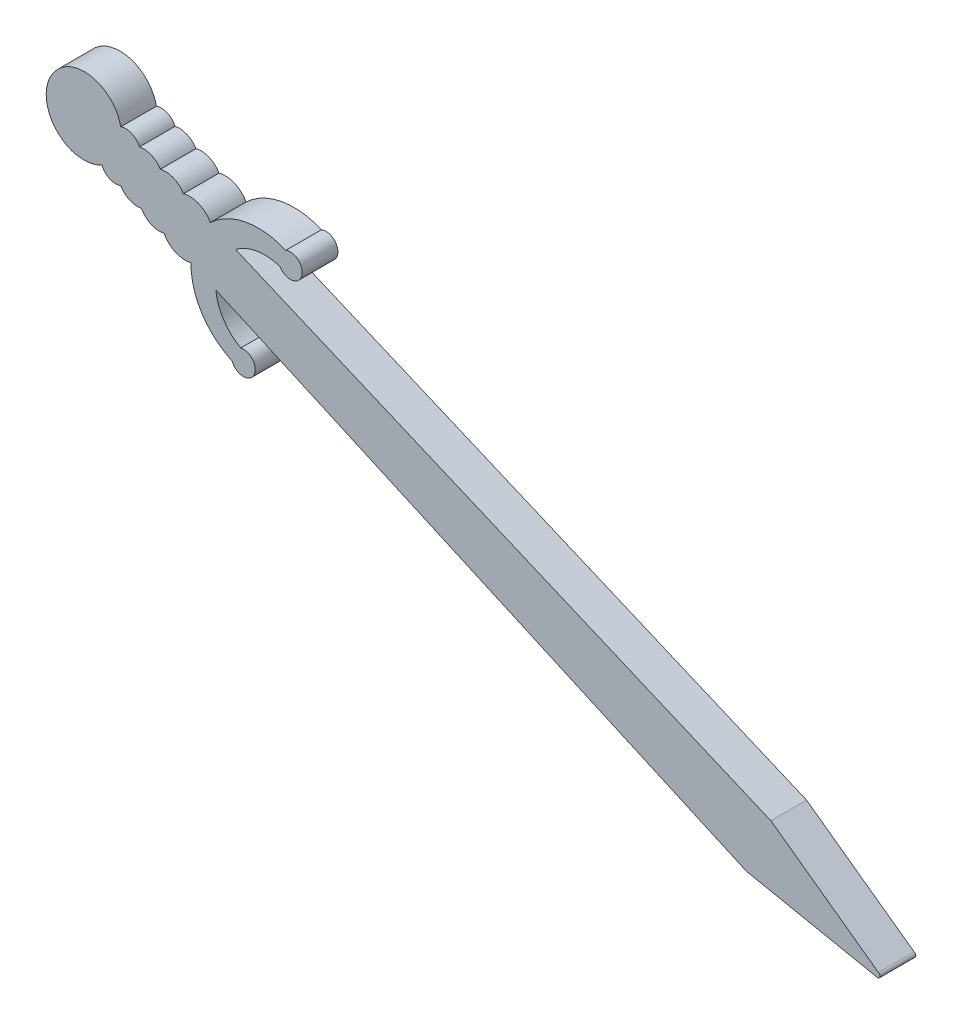
ISO-10303-21;
HEADER;
FILE_DESCRIPTION(('STEP AP214'),'2;1');
FILE_NAME('part.step','',(''),(''),'','','');
FILE_SCHEMA(('AUTOMOTIVE_DESIGN { 1 0 10303 214 1 1 1 1 }'));
ENDSEC;
DATA;
#1=APPLICATION_CONTEXT('core data for automotive mechanical design processes');
#2=APPLICATION_PROTOCOL_DEFINITION('international standard','automotive_design',2000,#1);
#3=PRODUCT_CONTEXT('',#1,'mechanical');
#4=PRODUCT('Part','Part','',(#3));
#5=PRODUCT_RELATED_PRODUCT_CATEGORY('part','',(#4));
#6=PRODUCT_DEFINITION_FORMATION('','',#4);
#7=PRODUCT_DEFINITION_CONTEXT('part definition',#1,'design');
#8=PRODUCT_DEFINITION('design','',#6,#7);
#9=PRODUCT_DEFINITION_SHAPE('','',#8);
#10=(LENGTH_UNIT() NAMED_UNIT(*) SI_UNIT(.MILLI.,.METRE.));
#11=(NAMED_UNIT(*) PLANE_ANGLE_UNIT() SI_UNIT($,.RADIAN.));
#12=(NAMED_UNIT(*) SI_UNIT($,.STERADIAN.) SOLID_ANGLE_UNIT());
#13=UNCERTAINTY_MEASURE_WITH_UNIT(LENGTH_MEASURE(1.E-05),#10,'distance_accuracy_value','');
#14=(GEOMETRIC_REPRESENTATION_CONTEXT(3) GLOBAL_UNCERTAINTY_ASSIGNED_CONTEXT((#13)) GLOBAL_UNIT_ASSIGNED_CONTEXT((#10,
#11,#12)) REPRESENTATION_CONTEXT('',''));
#15=CARTESIAN_POINT('',(0.,0.,0.));
#16=DIRECTION('',(0.,0.,1.));
#17=DIRECTION('',(1.,0.,0.));
#18=AXIS2_PLACEMENT_3D('',#15,#16,#17);
#19=CARTESIAN_POINT('',(10.7725840716379,28.2764806744875,3.));
#20=DIRECTION('',(0.,0.,-1.));
#21=DIRECTION('',(-1.,0.,0.));
#22=AXIS2_PLACEMENT_3D('',#19,#20,#21);
#23=CYLINDRICAL_SURFACE('',#22,1.98189008636702);
#24=CARTESIAN_POINT('',(10.7725840716379,28.2764806744875,0.));
#25=DIRECTION('',(0.,0.,1.));
#26=DIRECTION('',(1.,0.,0.));
#27=AXIS2_PLACEMENT_3D('',#24,#25,#26);
#28=CIRCLE('',#27,1.98189008636702);
#29=CARTESIAN_POINT('',(12.514190479064,29.2223640901642,0.));
#30=VERTEX_POINT('',#29);
#31=CARTESIAN_POINT('',(10.2421095588629,30.1860578805035,0.));
#32=VERTEX_POINT('',#31);
#33=EDGE_CURVE('E219',#30,#32,#28,.T.);
#34=ORIENTED_EDGE('',*,*,#33,.T.);
#35=DIRECTION('',(0.,0.,-1.));
#36=VECTOR('',#35,1.);
#37=CARTESIAN_POINT('',(10.2421095588629,30.1860578805035,3.));
#38=LINE('',#37,#36);
#39=CARTESIAN_POINT('',(10.2421095588629,30.1860578805035,3.));
#40=VERTEX_POINT('',#39);
#41=EDGE_CURVE('E11',#40,#32,#38,.T.);
#42=ORIENTED_EDGE('',*,*,#41,.F.);
#43=CARTESIAN_POINT('',(10.7725840716379,28.2764806744875,3.));
#44=DIRECTION('',(0.,0.,1.));
#45=DIRECTION('',(1.,0.,0.));
#46=AXIS2_PLACEMENT_3D('',#43,#44,#45);
#47=CIRCLE('',#46,1.98189008636702);
#48=CARTESIAN_POINT('',(12.514190479064,29.2223640901642,3.));
#49=VERTEX_POINT('',#48);
#50=EDGE_CURVE('E266',#49,#40,#47,.T.);
#51=ORIENTED_EDGE('',*,*,#50,.F.);
#52=DIRECTION('',(0.,0.,-1.));
#53=VECTOR('',#52,1.);
#54=CARTESIAN_POINT('',(12.514190479064,29.2223640901642,3.));
#55=LINE('',#54,#53);
#56=EDGE_CURVE('E215',#49,#30,#55,.T.);
#57=ORIENTED_EDGE('',*,*,#56,.T.);
#58=EDGE_LOOP('',(#34,#42,#51,#57));
#59=FACE_BOUND('',#58,.T.);
#60=ADVANCED_FACE('F33',(#59),#23,.T.);
#61=CARTESIAN_POINT('',(8.7357397816257,29.3211563541974,3.));
#62=DIRECTION('',(0.,0.,-1.));
#63=DIRECTION('',(-1.,0.,0.));
#64=AXIS2_PLACEMENT_3D('',#61,#62,#63);
#65=CYLINDRICAL_SURFACE('',#64,1.73701023485195);
#66=CARTESIAN_POINT('',(8.7357397816257,29.3211563541974,0.));
#67=DIRECTION('',(0.,0.,1.));
#68=DIRECTION('',(1.,0.,0.));
#69=AXIS2_PLACEMENT_3D('',#66,#67,#68);
#70=CIRCLE('',#69,1.73701023485195);
#71=CARTESIAN_POINT('',(8.31054654521642,31.005322399364,0.));
#72=VERTEX_POINT('',#71);
#73=EDGE_CURVE('E222',#32,#72,#70,.T.);
#74=ORIENTED_EDGE('',*,*,#73,.T.);
#75=DIRECTION('',(0.,0.,-1.));
#76=VECTOR('',#75,1.);
#77=CARTESIAN_POINT('',(8.31054654521642,31.005322399364,3.));
#78=LINE('',#77,#76);
#79=CARTESIAN_POINT('',(8.31054654521642,31.005322399364,3.));
#80=VERTEX_POINT('',#79);
#81=EDGE_CURVE('E41',#80,#72,#78,.T.);
#82=ORIENTED_EDGE('',*,*,#81,.F.);
#83=CARTESIAN_POINT('',(8.7357397816257,29.3211563541974,3.));
#84=DIRECTION('',(0.,0.,1.));
#85=DIRECTION('',(1.,0.,0.));
#86=AXIS2_PLACEMENT_3D('',#83,#84,#85);
#87=CIRCLE('',#86,1.73701023485195);
#88=EDGE_CURVE('E137',#40,#80,#87,.T.);
#89=ORIENTED_EDGE('',*,*,#88,.F.);
#90=ORIENTED_EDGE('',*,*,#41,.T.);
#91=EDGE_LOOP('',(#74,#82,#89,#90));
#92=FACE_BOUND('',#91,.T.);
#93=ADVANCED_FACE('F398',(#92),#65,.T.);
#94=CARTESIAN_POINT('',(6.89581578273285,30.1170419432992,3.));
#95=DIRECTION('',(0.,0.,-1.));
#96=DIRECTION('',(-1.,0.,0.));
#97=AXIS2_PLACEMENT_3D('',#94,#95,#96);
#98=CYLINDRICAL_SURFACE('',#97,1.67048055928348);
#99=CARTESIAN_POINT('',(6.89581578273285,30.1170419432992,0.));
#100=DIRECTION('',(0.,0.,1.));
#101=DIRECTION('',(1.,0.,0.));
#102=AXIS2_PLACEMENT_3D('',#99,#100,#101);
#103=CIRCLE('',#102,1.67048055928348);
#104=CARTESIAN_POINT('',(6.55112543225311,31.7515736380761,0.));
#105=VERTEX_POINT('',#104);
#106=EDGE_CURVE('E224',#72,#105,#103,.T.);
#107=ORIENTED_EDGE('',*,*,#106,.T.);
#108=DIRECTION('',(0.,0.,-1.));
#109=VECTOR('',#108,1.);
#110=CARTESIAN_POINT('',(6.55112543225311,31.7515736380761,3.));
#111=LINE('',#110,#109);
#112=CARTESIAN_POINT('',(6.55112543225311,31.7515736380761,3.));
#113=VERTEX_POINT('',#112);
#114=EDGE_CURVE('E318',#113,#105,#111,.T.);
#115=ORIENTED_EDGE('',*,*,#114,.F.);
#116=CARTESIAN_POINT('',(6.89581578273285,30.1170419432992,3.));
#117=DIRECTION('',(0.,0.,1.));
#118=DIRECTION('',(1.,0.,0.));
#119=AXIS2_PLACEMENT_3D('',#116,#117,#118);
#120=CIRCLE('',#119,1.67048055928348);
#121=EDGE_CURVE('E326',#80,#113,#120,.T.);
#122=ORIENTED_EDGE('',*,*,#121,.F.);
#123=ORIENTED_EDGE('',*,*,#81,.T.);
#124=EDGE_LOOP('',(#107,#115,#122,#123));
#125=FACE_BOUND('',#124,.T.);
#126=ADVANCED_FACE('F324',(#125),#98,.T.);
#127=CARTESIAN_POINT('',(5.39405831613315,31.238699788047,3.));
#128=DIRECTION('',(0.,0.,-1.));
#129=DIRECTION('',(-1.,0.,0.));
#130=AXIS2_PLACEMENT_3D('',#127,#128,#129);
#131=CYLINDRICAL_SURFACE('',#130,1.26563971858101);
#132=CARTESIAN_POINT('',(5.39405831613315,31.238699788047,0.));
#133=DIRECTION('',(0.,0.,1.));
#134=DIRECTION('',(1.,0.,0.));
#135=AXIS2_PLACEMENT_3D('',#132,#133,#134);
#136=CIRCLE('',#135,1.26563971858101);
#137=CARTESIAN_POINT('',(4.98028227685291,32.4347906234635,0.));
#138=VERTEX_POINT('',#137);
#139=EDGE_CURVE('E226',#105,#138,#136,.T.);
#140=ORIENTED_EDGE('',*,*,#139,.T.);
#141=DIRECTION('',(0.,0.,-1.));
#142=VECTOR('',#141,1.);
#143=CARTESIAN_POINT('',(4.98028227685291,32.4347906234635,3.));
#144=LINE('',#143,#142);
#145=CARTESIAN_POINT('',(4.98028227685291,32.4347906234635,3.));
#146=VERTEX_POINT('',#145);
#147=EDGE_CURVE('E315',#146,#138,#144,.T.);
#148=ORIENTED_EDGE('',*,*,#147,.F.);
#149=CARTESIAN_POINT('',(5.39405831613315,31.238699788047,3.));
#150=DIRECTION('',(0.,0.,1.));
#151=DIRECTION('',(1.,0.,0.));
#152=AXIS2_PLACEMENT_3D('',#149,#150,#151);
#153=CIRCLE('',#152,1.26563971858101);
#154=EDGE_CURVE('E344',#113,#146,#153,.T.);
#155=ORIENTED_EDGE('',*,*,#154,.F.);
#156=ORIENTED_EDGE('',*,*,#114,.T.);
#157=EDGE_LOOP('',(#140,#148,#155,#156));
#158=FACE_BOUND('',#157,.T.);
#159=ADVANCED_FACE('F335',(#158),#131,.T.);
#160=CARTESIAN_POINT('',(1.91906840683006,31.7855996630397,3.));
#161=DIRECTION('',(0.,0.,-1.));
#162=DIRECTION('',(-1.,0.,0.));
#163=AXIS2_PLACEMENT_3D('',#160,#161,#162);
#164=CYLINDRICAL_SURFACE('',#163,3.12929373199708);
#165=CARTESIAN_POINT('',(1.91906840683006,31.7855996630397,0.));
#166=DIRECTION('',(0.,0.,1.));
#167=DIRECTION('',(1.,0.,0.));
#168=AXIS2_PLACEMENT_3D('',#165,#166,#167);
#169=CIRCLE('',#168,3.12929373199708);
#170=CARTESIAN_POINT('',(-0.691279818594206,33.5114505845102,0.));
#171=VERTEX_POINT('',#170);
#172=EDGE_CURVE('E228',#138,#171,#169,.T.);
#173=ORIENTED_EDGE('',*,*,#172,.T.);
#174=DIRECTION('',(0.,0.,-1.));
#175=VECTOR('',#174,1.);
#176=CARTESIAN_POINT('',(-0.691279818594206,33.5114505845102,3.));
#177=LINE('',#176,#175);
#178=CARTESIAN_POINT('',(-0.691279818594206,33.5114505845102,3.));
#179=VERTEX_POINT('',#178);
#180=EDGE_CURVE('E312',#179,#171,#177,.T.);
#181=ORIENTED_EDGE('',*,*,#180,.F.);
#182=CARTESIAN_POINT('',(1.91906840683006,31.7855996630397,3.));
#183=DIRECTION('',(0.,0.,1.));
#184=DIRECTION('',(1.,0.,0.));
#185=AXIS2_PLACEMENT_3D('',#182,#183,#184);
#186=CIRCLE('',#185,3.12929373199708);
#187=EDGE_CURVE('E341',#146,#179,#186,.T.);
#188=ORIENTED_EDGE('',*,*,#187,.F.);
#189=ORIENTED_EDGE('',*,*,#147,.T.);
#190=EDGE_LOOP('',(#173,#181,#188,#189));
#191=FACE_BOUND('',#190,.T.);
#192=ADVANCED_FACE('F339',(#191),#164,.T.);
#193=CARTESIAN_POINT('',(1.89397271545363,31.6534021474657,3.));
#194=DIRECTION('',(0.,0.,-1.));
#195=DIRECTION('',(-1.,0.,0.));
#196=AXIS2_PLACEMENT_3D('',#193,#194,#195);
#197=CYLINDRICAL_SURFACE('',#196,3.18368884459592);
#198=CARTESIAN_POINT('',(1.89397271545363,31.6534021474657,0.));
#199=DIRECTION('',(0.,0.,1.));
#200=DIRECTION('',(1.,0.,0.));
#201=AXIS2_PLACEMENT_3D('',#198,#199,#200);
#202=CIRCLE('',#201,3.18368884459592);
#203=CARTESIAN_POINT('',(0.0625214743602495,29.0492399000814,0.));
#204=VERTEX_POINT('',#203);
#205=EDGE_CURVE('E230',#171,#204,#202,.T.);
#206=ORIENTED_EDGE('',*,*,#205,.T.);
#207=DIRECTION('',(0.,0.,-1.));
#208=VECTOR('',#207,1.);
#209=CARTESIAN_POINT('',(0.0625214743602495,29.0492399000814,3.));
#210=LINE('',#209,#208);
#211=CARTESIAN_POINT('',(0.0625214743602495,29.0492399000814,3.));
#212=VERTEX_POINT('',#211);
#213=EDGE_CURVE('E309',#212,#204,#210,.T.);
#214=ORIENTED_EDGE('',*,*,#213,.F.);
#215=CARTESIAN_POINT('',(1.89397271545363,31.6534021474657,3.));
#216=DIRECTION('',(0.,0.,1.));
#217=DIRECTION('',(1.,0.,0.));
#218=AXIS2_PLACEMENT_3D('',#215,#216,#217);
#219=CIRCLE('',#218,3.18368884459592);
#220=EDGE_CURVE('E343',#179,#212,#219,.T.);
#221=ORIENTED_EDGE('',*,*,#220,.F.);
#222=ORIENTED_EDGE('',*,*,#180,.T.);
#223=EDGE_LOOP('',(#206,#214,#221,#222));
#224=FACE_BOUND('',#223,.T.);
#225=ADVANCED_FACE('F411',(#224),#197,.T.);
#226=CARTESIAN_POINT('',(1.69773823578186,31.1490586997284,3.));
#227=DIRECTION('',(0.,0.,-1.));
#228=DIRECTION('',(-1.,0.,0.));
#229=AXIS2_PLACEMENT_3D('',#226,#227,#228);
#230=CYLINDRICAL_SURFACE('',#229,2.66142308703174);
#231=CARTESIAN_POINT('',(1.69773823578186,31.1490586997284,0.));
#232=DIRECTION('',(0.,0.,1.));
#233=DIRECTION('',(1.,0.,0.));
#234=AXIS2_PLACEMENT_3D('',#231,#232,#233);
#235=CIRCLE('',#234,2.66142308703174);
#236=CARTESIAN_POINT('',(1.48376054940559,28.4962514323381,0.));
#237=VERTEX_POINT('',#236);
#238=EDGE_CURVE('E232',#204,#237,#235,.T.);
#239=ORIENTED_EDGE('',*,*,#238,.T.);
#240=DIRECTION('',(0.,0.,-1.));
#241=VECTOR('',#240,1.);
#242=CARTESIAN_POINT('',(1.48376054940559,28.4962514323381,3.));
#243=LINE('',#242,#241);
#244=CARTESIAN_POINT('',(1.48376054940559,28.4962514323381,3.));
#245=VERTEX_POINT('',#244);
#246=EDGE_CURVE('E306',#245,#237,#243,.T.);
#247=ORIENTED_EDGE('',*,*,#246,.F.);
#248=CARTESIAN_POINT('',(1.69773823578186,31.1490586997284,3.));
#249=DIRECTION('',(0.,0.,1.));
#250=DIRECTION('',(1.,0.,0.));
#251=AXIS2_PLACEMENT_3D('',#248,#249,#250);
#252=CIRCLE('',#251,2.66142308703174);
#253=EDGE_CURVE('E346',#212,#245,#252,.T.);
#254=ORIENTED_EDGE('',*,*,#253,.F.);
#255=ORIENTED_EDGE('',*,*,#213,.T.);
#256=EDGE_LOOP('',(#239,#247,#254,#255));
#257=FACE_BOUND('',#256,.T.);
#258=ADVANCED_FACE('F414',(#257),#230,.T.);
#259=CARTESIAN_POINT('',(1.89397271545363,31.6534021474657,3.));
#260=DIRECTION('',(0.,0.,-1.));
#261=DIRECTION('',(-1.,0.,0.));
#262=AXIS2_PLACEMENT_3D('',#259,#260,#261);
#263=CYLINDRICAL_SURFACE('',#262,3.18368884459594);
#264=CARTESIAN_POINT('',(1.89397271545363,31.6534021474657,0.));
#265=DIRECTION('',(0.,0.,1.));
#266=DIRECTION('',(1.,0.,0.));
#267=AXIS2_PLACEMENT_3D('',#264,#265,#266);
#268=CIRCLE('',#267,3.18368884459594);
#269=CARTESIAN_POINT('',(3.39558917930571,28.8460862310265,0.));
#270=VERTEX_POINT('',#269);
#271=EDGE_CURVE('E234',#237,#270,#268,.T.);
#272=ORIENTED_EDGE('',*,*,#271,.T.);
#273=DIRECTION('',(0.,0.,-1.));
#274=VECTOR('',#273,1.);
#275=CARTESIAN_POINT('',(3.39558917930571,28.8460862310265,3.));
#276=LINE('',#275,#274);
#277=CARTESIAN_POINT('',(3.39558917930571,28.8460862310265,3.));
#278=VERTEX_POINT('',#277);
#279=EDGE_CURVE('E303',#278,#270,#276,.T.);
#280=ORIENTED_EDGE('',*,*,#279,.F.);
#281=CARTESIAN_POINT('',(1.89397271545363,31.6534021474657,3.));
#282=DIRECTION('',(0.,0.,1.));
#283=DIRECTION('',(1.,0.,0.));
#284=AXIS2_PLACEMENT_3D('',#281,#282,#283);
#285=CIRCLE('',#284,3.18368884459594);
#286=EDGE_CURVE('E352',#245,#278,#285,.T.);
#287=ORIENTED_EDGE('',*,*,#286,.F.);
#288=ORIENTED_EDGE('',*,*,#246,.T.);
#289=EDGE_LOOP('',(#272,#280,#287,#288));
#290=FACE_BOUND('',#289,.T.);
#291=ADVANCED_FACE('F418',(#290),#263,.T.);
#292=CARTESIAN_POINT('',(4.56306841894166,29.334794858195,3.));
#293=DIRECTION('',(0.,0.,-1.));
#294=DIRECTION('',(-1.,0.,0.));
#295=AXIS2_PLACEMENT_3D('',#292,#293,#294);
#296=CYLINDRICAL_SURFACE('',#295,1.26563971858101);
#297=CARTESIAN_POINT('',(4.56306841894166,29.334794858195,0.));
#298=DIRECTION('',(0.,0.,1.));
#299=DIRECTION('',(1.,0.,0.));
#300=AXIS2_PLACEMENT_3D('',#297,#298,#299);
#301=CIRCLE('',#300,1.26563971858101);
#302=CARTESIAN_POINT('',(4.9737678275434,28.1376441187206,0.));
#303=VERTEX_POINT('',#302);
#304=EDGE_CURVE('E236',#270,#303,#301,.T.);
#305=ORIENTED_EDGE('',*,*,#304,.T.);
#306=DIRECTION('',(0.,0.,-1.));
#307=VECTOR('',#306,1.);
#308=CARTESIAN_POINT('',(4.9737678275434,28.1376441187206,3.));
#309=LINE('',#308,#307);
#310=CARTESIAN_POINT('',(4.9737678275434,28.1376441187206,3.));
#311=VERTEX_POINT('',#310);
#312=EDGE_CURVE('E300',#311,#303,#309,.T.);
#313=ORIENTED_EDGE('',*,*,#312,.F.);
#314=CARTESIAN_POINT('',(4.56306841894166,29.334794858195,3.));
#315=DIRECTION('',(0.,0.,1.));
#316=DIRECTION('',(1.,0.,0.));
#317=AXIS2_PLACEMENT_3D('',#314,#315,#316);
#318=CIRCLE('',#317,1.26563971858101);
#319=EDGE_CURVE('E354',#278,#311,#318,.T.);
#320=ORIENTED_EDGE('',*,*,#319,.F.);
#321=ORIENTED_EDGE('',*,*,#279,.T.);
#322=EDGE_LOOP('',(#305,#313,#320,#321));
#323=FACE_BOUND('',#322,.T.);
#324=ADVANCED_FACE('F422',(#323),#296,.T.);
#325=CARTESIAN_POINT('',(6.40665939305559,28.9963216253715,3.));
#326=DIRECTION('',(0.,0.,-1.));
#327=DIRECTION('',(-1.,0.,0.));
#328=AXIS2_PLACEMENT_3D('',#325,#326,#327);
#329=CYLINDRICAL_SURFACE('',#328,1.67048055928348);
#330=CARTESIAN_POINT('',(6.40665939305559,28.9963216253715,0.));
#331=DIRECTION('',(0.,0.,1.));
#332=DIRECTION('',(1.,0.,0.));
#333=AXIS2_PLACEMENT_3D('',#330,#331,#332);
#334=CIRCLE('',#333,1.67048055928348);
#335=CARTESIAN_POINT('',(6.7172948097632,27.3549773784717,0.));
#336=VERTEX_POINT('',#335);
#337=EDGE_CURVE('E238',#303,#336,#334,.T.);
#338=ORIENTED_EDGE('',*,*,#337,.T.);
#339=DIRECTION('',(0.,0.,-1.));
#340=VECTOR('',#339,1.);
#341=CARTESIAN_POINT('',(6.7172948097632,27.3549773784717,3.));
#342=LINE('',#341,#340);
#343=CARTESIAN_POINT('',(6.7172948097632,27.3549773784717,3.));
#344=VERTEX_POINT('',#343);
#345=EDGE_CURVE('E297',#344,#336,#342,.T.);
#346=ORIENTED_EDGE('',*,*,#345,.F.);
#347=CARTESIAN_POINT('',(6.40665939305559,28.9963216253715,3.));
#348=DIRECTION('',(0.,0.,1.));
#349=DIRECTION('',(1.,0.,0.));
#350=AXIS2_PLACEMENT_3D('',#347,#348,#349);
#351=CIRCLE('',#350,1.67048055928348);
#352=EDGE_CURVE('E356',#311,#344,#351,.T.);
#353=ORIENTED_EDGE('',*,*,#352,.F.);
#354=ORIENTED_EDGE('',*,*,#312,.T.);
#355=EDGE_LOOP('',(#338,#346,#353,#354));
#356=FACE_BOUND('',#355,.T.);
#357=ADVANCED_FACE('F426',(#356),#329,.T.);
#358=CARTESIAN_POINT('',(8.24131955843662,28.1883759154343,3.));
#359=DIRECTION('',(0.,0.,-1.));
#360=DIRECTION('',(-1.,0.,0.));
#361=AXIS2_PLACEMENT_3D('',#358,#359,#360);
#362=CYLINDRICAL_SURFACE('',#361,1.73701023485195);
#363=CARTESIAN_POINT('',(8.24131955843662,28.1883759154343,0.));
#364=DIRECTION('',(0.,0.,1.));
#365=DIRECTION('',(1.,0.,0.));
#366=AXIS2_PLACEMENT_3D('',#363,#364,#365);
#367=CIRCLE('',#366,1.73701023485195);
#368=CARTESIAN_POINT('',(8.6314086096589,26.4957344625279,0.));
#369=VERTEX_POINT('',#368);
#370=EDGE_CURVE('E240',#336,#369,#367,.T.);
#371=ORIENTED_EDGE('',*,*,#370,.T.);
#372=DIRECTION('',(0.,0.,-1.));
#373=VECTOR('',#372,1.);
#374=CARTESIAN_POINT('',(8.6314086096589,26.4957344625279,3.));
#375=LINE('',#374,#373);
#376=CARTESIAN_POINT('',(8.6314086096589,26.4957344625279,3.));
#377=VERTEX_POINT('',#376);
#378=EDGE_CURVE('E294',#377,#369,#375,.T.);
#379=ORIENTED_EDGE('',*,*,#378,.F.);
#380=CARTESIAN_POINT('',(8.24131955843662,28.1883759154343,3.));
#381=DIRECTION('',(0.,0.,1.));
#382=DIRECTION('',(1.,0.,0.));
#383=AXIS2_PLACEMENT_3D('',#380,#381,#382);
#384=CIRCLE('',#383,1.73701023485195);
#385=EDGE_CURVE('E358',#344,#377,#384,.T.);
#386=ORIENTED_EDGE('',*,*,#385,.F.);
#387=ORIENTED_EDGE('',*,*,#345,.T.);
#388=EDGE_LOOP('',(#371,#379,#386,#387));
#389=FACE_BOUND('',#388,.T.);
#390=ADVANCED_FACE('F430',(#389),#362,.T.);
#391=CARTESIAN_POINT('',(10.3923026904429,27.4052070298437,3.));
#392=DIRECTION('',(0.,0.,-1.));
#393=DIRECTION('',(-1.,0.,0.));
#394=AXIS2_PLACEMENT_3D('',#391,#392,#393);
#395=CYLINDRICAL_SURFACE('',#394,1.98189008636703);
#396=CARTESIAN_POINT('',(10.3923026904429,27.4052070298437,0.));
#397=DIRECTION('',(0.,0.,1.));
#398=DIRECTION('',(1.,0.,0.));
#399=AXIS2_PLACEMENT_3D('',#396,#397,#398);
#400=CIRCLE('',#399,1.98189008636703);
#401=CARTESIAN_POINT('',(10.8829641701613,25.4850144283684,0.));
#402=VERTEX_POINT('',#401);
#403=EDGE_CURVE('E242',#369,#402,#400,.T.);
#404=ORIENTED_EDGE('',*,*,#403,.T.);
#405=DIRECTION('',(0.,0.,-1.));
#406=VECTOR('',#405,1.);
#407=CARTESIAN_POINT('',(10.8829641701613,25.4850144283684,3.));
#408=LINE('',#407,#406);
#409=CARTESIAN_POINT('',(10.8829641701613,25.4850144283684,3.));
#410=VERTEX_POINT('',#409);
#411=EDGE_CURVE('E291',#410,#402,#408,.T.);
#412=ORIENTED_EDGE('',*,*,#411,.F.);
#413=CARTESIAN_POINT('',(10.3923026904429,27.4052070298437,3.));
#414=DIRECTION('',(0.,0.,1.));
#415=DIRECTION('',(1.,0.,0.));
#416=AXIS2_PLACEMENT_3D('',#413,#414,#415);
#417=CIRCLE('',#416,1.98189008636703);
#418=EDGE_CURVE('E360',#377,#410,#417,.T.);
#419=ORIENTED_EDGE('',*,*,#418,.F.);
#420=ORIENTED_EDGE('',*,*,#378,.T.);
#421=EDGE_LOOP('',(#404,#412,#419,#420));
#422=FACE_BOUND('',#421,.T.);
#423=ADVANCED_FACE('F434',(#422),#395,.T.);
#424=CARTESIAN_POINT('',(16.7474408095972,25.4036086774406,3.));
#425=DIRECTION('',(0.,0.,-1.));
#426=DIRECTION('',(-1.,0.,0.));
#427=AXIS2_PLACEMENT_3D('',#424,#425,#426);
#428=CYLINDRICAL_SURFACE('',#427,5.86504161543412);
#429=CARTESIAN_POINT('',(16.7474408095972,25.4036086774406,0.));
#430=DIRECTION('',(0.,0.,1.));
#431=DIRECTION('',(1.,0.,0.));
#432=AXIS2_PLACEMENT_3D('',#429,#430,#431);
#433=CIRCLE('',#432,5.86504161543412);
#434=CARTESIAN_POINT('',(14.3507216089646,20.0506235080148,0.));
#435=VERTEX_POINT('',#434);
#436=EDGE_CURVE('E244',#402,#435,#433,.T.);
#437=ORIENTED_EDGE('',*,*,#436,.T.);
#438=DIRECTION('',(0.,0.,-1.));
#439=VECTOR('',#438,1.);
#440=CARTESIAN_POINT('',(14.3507216089646,20.0506235080148,3.));
#441=LINE('',#440,#439);
#442=CARTESIAN_POINT('',(14.3507216089646,20.0506235080148,3.));
#443=VERTEX_POINT('',#442);
#444=EDGE_CURVE('E288',#443,#435,#441,.T.);
#445=ORIENTED_EDGE('',*,*,#444,.F.);
#446=CARTESIAN_POINT('',(16.7474408095972,25.4036086774406,3.));
#447=DIRECTION('',(0.,0.,1.));
#448=DIRECTION('',(1.,0.,0.));
#449=AXIS2_PLACEMENT_3D('',#446,#447,#448);
#450=CIRCLE('',#449,5.86504161543412);
#451=EDGE_CURVE('E362',#410,#443,#450,.T.);
#452=ORIENTED_EDGE('',*,*,#451,.F.);
#453=ORIENTED_EDGE('',*,*,#411,.T.);
#454=EDGE_LOOP('',(#437,#445,#452,#453));
#455=FACE_BOUND('',#454,.T.);
#456=ADVANCED_FACE('F438',(#455),#428,.T.);
#457=CARTESIAN_POINT('',(15.2882321272035,20.3985804424067,3.));
#458=DIRECTION('',(0.,0.,-1.));
#459=DIRECTION('',(-1.,0.,0.));
#460=AXIS2_PLACEMENT_3D('',#457,#458,#459);
#461=CYLINDRICAL_SURFACE('',#460,1.);
#462=CARTESIAN_POINT('',(15.2882321272035,20.3985804424067,0.));
#463=DIRECTION('',(0.,0.,1.));
#464=DIRECTION('',(1.,0.,0.));
#465=AXIS2_PLACEMENT_3D('',#462,#463,#464);
#466=CIRCLE('',#465,1.);
#467=CARTESIAN_POINT('',(15.0712029257411,21.3747455543178,0.));
#468=VERTEX_POINT('',#467);
#469=EDGE_CURVE('E246',#435,#468,#466,.T.);
#470=ORIENTED_EDGE('',*,*,#469,.T.);
#471=DIRECTION('',(0.,0.,-1.));
#472=VECTOR('',#471,1.);
#473=CARTESIAN_POINT('',(15.0712029257411,21.3747455543178,3.));
#474=LINE('',#473,#472);
#475=CARTESIAN_POINT('',(15.0712029257411,21.3747455543178,3.));
#476=VERTEX_POINT('',#475);
#477=EDGE_CURVE('E285',#476,#468,#474,.T.);
#478=ORIENTED_EDGE('',*,*,#477,.F.);
#479=CARTESIAN_POINT('',(15.2882321272035,20.3985804424067,3.));
#480=DIRECTION('',(0.,0.,1.));
#481=DIRECTION('',(1.,0.,0.));
#482=AXIS2_PLACEMENT_3D('',#479,#480,#481);
#483=CIRCLE('',#482,1.);
#484=EDGE_CURVE('E364',#443,#476,#483,.T.);
#485=ORIENTED_EDGE('',*,*,#484,.F.);
#486=ORIENTED_EDGE('',*,*,#444,.T.);
#487=EDGE_LOOP('',(#470,#478,#485,#486));
#488=FACE_BOUND('',#487,.T.);
#489=ADVANCED_FACE('F442',(#488),#461,.T.);
#490=CARTESIAN_POINT('',(17.01604891278,24.9343368004538,3.));
#491=DIRECTION('',(0.,0.,-1.));
#492=DIRECTION('',(-1.,0.,0.));
#493=AXIS2_PLACEMENT_3D('',#490,#491,#492);
#494=CYLINDRICAL_SURFACE('',#493,4.05624404503344);
#495=CARTESIAN_POINT('',(17.01604891278,24.9343368004538,0.));
#496=DIRECTION('',(0.,0.,-1.));
#497=DIRECTION('',(1.,0.,0.));
#498=AXIS2_PLACEMENT_3D('',#495,#496,#497);
#499=CIRCLE('',#498,4.05624404503344);
#500=CARTESIAN_POINT('',(12.9786022239576,24.5442855374295,0.));
#501=VERTEX_POINT('',#500);
#502=EDGE_CURVE('E248',#468,#501,#499,.T.);
#503=ORIENTED_EDGE('',*,*,#502,.T.);
#504=DIRECTION('',(0.,0.,-1.));
#505=VECTOR('',#504,1.);
#506=CARTESIAN_POINT('',(12.9786022239576,24.5442855374295,3.));
#507=LINE('',#506,#505);
#508=CARTESIAN_POINT('',(12.9786022239576,24.5442855374295,3.));
#509=VERTEX_POINT('',#508);
#510=EDGE_CURVE('E282',#509,#501,#507,.T.);
#511=ORIENTED_EDGE('',*,*,#510,.F.);
#512=CARTESIAN_POINT('',(17.01604891278,24.9343368004538,3.));
#513=DIRECTION('',(0.,0.,-1.));
#514=DIRECTION('',(1.,0.,0.));
#515=AXIS2_PLACEMENT_3D('',#512,#513,#514);
#516=CIRCLE('',#515,4.05624404503344);
#517=EDGE_CURVE('E366',#476,#509,#516,.T.);
#518=ORIENTED_EDGE('',*,*,#517,.F.);
#519=ORIENTED_EDGE('',*,*,#477,.T.);
#520=EDGE_LOOP('',(#503,#511,#518,#519));
#521=FACE_BOUND('',#520,.T.);
#522=ADVANCED_FACE('F446',(#521),#494,.F.);
#523=CARTESIAN_POINT('',(16.5463818465992,22.9427144257377,3.));
#524=DIRECTION('',(0.409528873822564,0.912297156361688,0.));
#525=DIRECTION('',(-0.912297156361688,0.409528873822564,0.));
#526=AXIS2_PLACEMENT_3D('',#523,#524,#525);
#527=PLANE('',#526);
#528=DIRECTION('',(0.912297156361688,-0.409528873822564,0.));
#529=VECTOR('',#528,1.);
#530=CARTESIAN_POINT('',(16.5463818465992,22.9427144257377,0.));
#531=LINE('',#530,#529);
#532=CARTESIAN_POINT('',(57.5858056278168,4.52017645524141,0.));
#533=VERTEX_POINT('',#532);
#534=EDGE_CURVE('E251',#501,#533,#531,.T.);
#535=ORIENTED_EDGE('',*,*,#534,.T.);
#536=DIRECTION('',(0.,0.,-1.));
#537=VECTOR('',#536,1.);
#538=CARTESIAN_POINT('',(57.5858056278168,4.52017645524141,3.));
#539=LINE('',#538,#537);
#540=CARTESIAN_POINT('',(57.5858056278168,4.52017645524141,3.));
#541=VERTEX_POINT('',#540);
#542=EDGE_CURVE('E279',#541,#533,#539,.T.);
#543=ORIENTED_EDGE('',*,*,#542,.F.);
#544=DIRECTION('',(0.912297156361692,-0.409528873822556,0.));
#545=VECTOR('',#544,1.);
#546=CARTESIAN_POINT('',(12.9786022239576,24.5442855374295,3.));
#547=LINE('',#546,#545);
#548=EDGE_CURVE('E368',#509,#541,#547,.T.);
#549=ORIENTED_EDGE('',*,*,#548,.F.);
#550=ORIENTED_EDGE('',*,*,#510,.T.);
#551=EDGE_LOOP('',(#535,#543,#549,#550));
#552=FACE_BOUND('',#551,.T.);
#553=ADVANCED_FACE('F450',(#552),#527,.F.);
#554=CARTESIAN_POINT('',(66.7140169333283,2.67536822642602,3.));
#555=DIRECTION('',(0.198094613016944,0.980182903489786,0.));
#556=DIRECTION('',(-0.980182903489786,0.198094613016944,0.));
#557=AXIS2_PLACEMENT_3D('',#554,#555,#556);
#558=PLANE('',#557);
#559=DIRECTION('',(0.980182903489786,-0.198094613016944,0.));
#560=VECTOR('',#559,1.);
#561=CARTESIAN_POINT('',(66.7140169333283,2.67536822642602,0.));
#562=LINE('',#561,#560);
#563=CARTESIAN_POINT('',(68.5380770105621,2.30672633945491,0.));
#564=VERTEX_POINT('',#563);
#565=EDGE_CURVE('E254',#533,#564,#562,.T.);
#566=ORIENTED_EDGE('',*,*,#565,.T.);
#567=DIRECTION('',(0.,0.,-1.));
#568=VECTOR('',#567,1.);
#569=CARTESIAN_POINT('',(68.5380770105621,2.30672633945491,3.));
#570=LINE('',#569,#568);
#571=CARTESIAN_POINT('',(68.5380770105621,2.30672633945491,3.));
#572=VERTEX_POINT('',#571);
#573=EDGE_CURVE('E276',#572,#564,#570,.T.);
#574=ORIENTED_EDGE('',*,*,#573,.F.);
#575=DIRECTION('',(0.980182903489787,-0.198094613016938,0.));
#576=VECTOR('',#575,1.);
#577=CARTESIAN_POINT('',(57.5858056278168,4.52017645524141,3.));
#578=LINE('',#577,#576);
#579=EDGE_CURVE('E370',#541,#572,#578,.T.);
#580=ORIENTED_EDGE('',*,*,#579,.F.);
#581=ORIENTED_EDGE('',*,*,#542,.T.);
#582=EDGE_LOOP('',(#566,#574,#580,#581));
#583=FACE_BOUND('',#582,.T.);
#584=ADVANCED_FACE('F454',(#583),#558,.F.);
#585=CARTESIAN_POINT('',(68.6159193651558,2.50420494358806,3.));
#586=DIRECTION('',(0.,0.,-1.));
#587=DIRECTION('',(-1.,0.,0.));
#588=AXIS2_PLACEMENT_3D('',#585,#586,#587);
#589=CYLINDRICAL_SURFACE('',#588,0.212266886864333);
#590=CARTESIAN_POINT('',(68.6159193651558,2.50420494358806,0.));
#591=DIRECTION('',(0.,0.,1.));
#592=DIRECTION('',(1.,0.,0.));
#593=AXIS2_PLACEMENT_3D('',#590,#591,#592);
#594=CIRCLE('',#593,0.212266886864333);
#595=CARTESIAN_POINT('',(68.6937617197495,2.70168354772122,0.));
#596=VERTEX_POINT('',#595);
#597=EDGE_CURVE('E256',#564,#596,#594,.T.);
#598=ORIENTED_EDGE('',*,*,#597,.T.);
#599=DIRECTION('',(0.,0.,-1.));
#600=VECTOR('',#599,1.);
#601=CARTESIAN_POINT('',(68.6937617197495,2.70168354772122,3.));
#602=LINE('',#601,#600);
#603=CARTESIAN_POINT('',(68.6937617197495,2.70168354772122,3.));
#604=VERTEX_POINT('',#603);
#605=EDGE_CURVE('E273',#604,#596,#602,.T.);
#606=ORIENTED_EDGE('',*,*,#605,.F.);
#607=CARTESIAN_POINT('',(68.6159193651558,2.50420494358806,3.));
#608=DIRECTION('',(0.,0.,1.));
#609=DIRECTION('',(1.,0.,0.));
#610=AXIS2_PLACEMENT_3D('',#607,#608,#609);
#611=CIRCLE('',#610,0.212266886864333);
#612=EDGE_CURVE('E372',#572,#604,#611,.T.);
#613=ORIENTED_EDGE('',*,*,#612,.F.);
#614=ORIENTED_EDGE('',*,*,#573,.T.);
#615=EDGE_LOOP('',(#598,#606,#613,#614));
#616=FACE_BOUND('',#615,.T.);
#617=ADVANCED_FACE('F458',(#616),#589,.T.);
#618=CARTESIAN_POINT('',(59.6427787566896,9.23296694026409,3.));
#619=DIRECTION('',(-0.585164443183523,-0.810914652989892,0.));
#620=DIRECTION('',(0.810914652989892,-0.585164443183523,0.));
#621=AXIS2_PLACEMENT_3D('',#618,#619,#620);
#622=PLANE('',#621);
#623=DIRECTION('',(-0.810914652989892,0.585164443183523,0.));
#624=VECTOR('',#623,1.);
#625=CARTESIAN_POINT('',(59.6427787566896,9.23296694026409,0.));
#626=LINE('',#625,#624);
#627=CARTESIAN_POINT('',(59.6427787566896,9.23296694026409,0.));
#628=VERTEX_POINT('',#627);
#629=EDGE_CURVE('E258',#596,#628,#626,.T.);
#630=ORIENTED_EDGE('',*,*,#629,.T.);
#631=DIRECTION('',(0.,0.,-1.));
#632=VECTOR('',#631,1.);
#633=CARTESIAN_POINT('',(59.6427787566896,9.23296694026409,3.));
#634=LINE('',#633,#632);
#635=CARTESIAN_POINT('',(59.6427787566896,9.23296694026409,3.));
#636=VERTEX_POINT('',#635);
#637=EDGE_CURVE('E270',#636,#628,#634,.T.);
#638=ORIENTED_EDGE('',*,*,#637,.F.);
#639=DIRECTION('',(-0.810914652989892,0.585164443183523,0.));
#640=VECTOR('',#639,1.);
#641=CARTESIAN_POINT('',(59.6427787566896,9.23296694026409,3.));
#642=LINE('',#641,#640);
#643=EDGE_CURVE('E374',#604,#636,#642,.T.);
#644=ORIENTED_EDGE('',*,*,#643,.F.);
#645=ORIENTED_EDGE('',*,*,#605,.T.);
#646=EDGE_LOOP('',(#630,#638,#644,#645));
#647=FACE_BOUND('',#646,.T.);
#648=ADVANCED_FACE('F380',(#647),#622,.F.);
#649=CARTESIAN_POINT('',(14.6289325361579,28.3254049323844,3.));
#650=DIRECTION('',(-0.390474532342379,-0.920613729851994,0.));
#651=DIRECTION('',(0.920613729851994,-0.390474532342379,0.));
#652=AXIS2_PLACEMENT_3D('',#649,#650,#651);
#653=PLANE('',#652);
#654=DIRECTION('',(-0.920613729851994,0.390474532342379,0.));
#655=VECTOR('',#654,1.);
#656=CARTESIAN_POINT('',(14.6289325361579,28.3254049323844,0.));
#657=LINE('',#656,#655);
#658=CARTESIAN_POINT('',(14.6289325361579,28.3254049323844,0.));
#659=VERTEX_POINT('',#658);
#660=EDGE_CURVE('E261',#628,#659,#657,.T.);
#661=ORIENTED_EDGE('',*,*,#660,.T.);
#662=DIRECTION('',(0.,0.,-1.));
#663=VECTOR('',#662,1.);
#664=CARTESIAN_POINT('',(14.6289325361579,28.3254049323844,3.));
#665=LINE('',#664,#663);
#666=CARTESIAN_POINT('',(14.6289325361579,28.3254049323844,3.));
#667=VERTEX_POINT('',#666);
#668=EDGE_CURVE('E210',#667,#659,#665,.T.);
#669=ORIENTED_EDGE('',*,*,#668,.F.);
#670=DIRECTION('',(-0.920613729851995,0.390474532342376,0.));
#671=VECTOR('',#670,1.);
#672=CARTESIAN_POINT('',(18.2292363218114,26.798350868983,3.));
#673=LINE('',#672,#671);
#674=EDGE_CURVE('E201',#636,#667,#673,.T.);
#675=ORIENTED_EDGE('',*,*,#674,.F.);
#676=ORIENTED_EDGE('',*,*,#637,.T.);
#677=EDGE_LOOP('',(#661,#669,#675,#676));
#678=FACE_BOUND('',#677,.T.);
#679=ADVANCED_FACE('F383',(#678),#653,.F.);
#680=CARTESIAN_POINT('',(17.0882418518207,25.0997401260594,3.));
#681=DIRECTION('',(0.,0.,-1.));
#682=DIRECTION('',(-1.,0.,0.));
#683=AXIS2_PLACEMENT_3D('',#680,#681,#682);
#684=CYLINDRICAL_SURFACE('',#683,4.05624404503344);
#685=CARTESIAN_POINT('',(17.0882418518207,25.0997401260594,0.));
#686=DIRECTION('',(0.,0.,-1.));
#687=DIRECTION('',(1.,0.,0.));
#688=AXIS2_PLACEMENT_3D('',#685,#686,#687);
#689=CIRCLE('',#688,4.05624404503344);
#690=CARTESIAN_POINT('',(18.375877706631,28.9461812939803,0.));
#691=VERTEX_POINT('',#690);
#692=EDGE_CURVE('E209',#659,#691,#689,.T.);
#693=ORIENTED_EDGE('',*,*,#692,.T.);
#694=DIRECTION('',(0.,0.,-1.));
#695=VECTOR('',#694,1.);
#696=CARTESIAN_POINT('',(18.375877706631,28.9461812939803,3.));
#697=LINE('',#696,#695);
#698=CARTESIAN_POINT('',(18.375877706631,28.9461812939803,3.));
#699=VERTEX_POINT('',#698);
#700=EDGE_CURVE('E206',#699,#691,#697,.T.);
#701=ORIENTED_EDGE('',*,*,#700,.F.);
#702=CARTESIAN_POINT('',(17.0882418518207,25.0997401260594,3.));
#703=DIRECTION('',(0.,0.,-1.));
#704=DIRECTION('',(1.,0.,0.));
#705=AXIS2_PLACEMENT_3D('',#702,#703,#704);
#706=CIRCLE('',#705,4.05624404503344);
#707=EDGE_CURVE('E195',#667,#699,#706,.T.);
#708=ORIENTED_EDGE('',*,*,#707,.F.);
#709=ORIENTED_EDGE('',*,*,#668,.T.);
#710=EDGE_LOOP('',(#693,#701,#708,#709));
#711=FACE_BOUND('',#710,.T.);
#712=ADVANCED_FACE('F207',(#711),#684,.F.);
#713=CARTESIAN_POINT('',(19.2392193230163,29.4508012038305,3.));
#714=DIRECTION('',(0.,0.,-1.));
#715=DIRECTION('',(-1.,0.,0.));
#716=AXIS2_PLACEMENT_3D('',#713,#714,#715);
#717=CYLINDRICAL_SURFACE('',#716,0.999999999999998);
#718=CARTESIAN_POINT('',(19.2392193230163,29.4508012038305,0.));
#719=DIRECTION('',(0.,0.,1.));
#720=DIRECTION('',(1.,0.,0.));
#721=AXIS2_PLACEMENT_3D('',#718,#719,#720);
#722=CIRCLE('',#721,0.999999999999998);
#723=CARTESIAN_POINT('',(18.8568854241045,30.3748254403865,0.));
#724=VERTEX_POINT('',#723);
#725=EDGE_CURVE('E123',#691,#724,#722,.T.);
#726=ORIENTED_EDGE('',*,*,#725,.T.);
#727=DIRECTION('',(0.,0.,-1.));
#728=VECTOR('',#727,1.);
#729=CARTESIAN_POINT('',(18.8568854241045,30.3748254403865,3.));
#730=LINE('',#729,#728);
#731=CARTESIAN_POINT('',(18.8568854241045,30.3748254403865,3.));
#732=VERTEX_POINT('',#731);
#733=EDGE_CURVE('E211',#732,#724,#730,.T.);
#734=ORIENTED_EDGE('',*,*,#733,.F.);
#735=CARTESIAN_POINT('',(19.2392193230163,29.4508012038305,3.));
#736=DIRECTION('',(0.,0.,1.));
#737=DIRECTION('',(1.,0.,0.));
#738=AXIS2_PLACEMENT_3D('',#735,#736,#737);
#739=CIRCLE('',#738,0.999999999999998);
#740=EDGE_CURVE('E199',#699,#732,#739,.T.);
#741=ORIENTED_EDGE('',*,*,#740,.F.);
#742=ORIENTED_EDGE('',*,*,#700,.T.);
#743=EDGE_LOOP('',(#726,#734,#741,#742));
#744=FACE_BOUND('',#743,.T.);
#745=ADVANCED_FACE('F213',(#744),#717,.T.);
#746=CARTESIAN_POINT('',(16.5615063031283,24.977608764936,3.));
#747=DIRECTION('',(0.,0.,-1.));
#748=DIRECTION('',(-1.,0.,0.));
#749=AXIS2_PLACEMENT_3D('',#746,#747,#748);
#750=CYLINDRICAL_SURFACE('',#749,5.86504161543412);
#751=CARTESIAN_POINT('',(16.5615063031283,24.977608764936,0.));
#752=DIRECTION('',(0.,0.,1.));
#753=DIRECTION('',(1.,0.,0.));
#754=AXIS2_PLACEMENT_3D('',#751,#752,#753);
#755=CIRCLE('',#754,5.86504161543412);
#756=EDGE_CURVE('E129',#724,#30,#755,.T.);
#757=ORIENTED_EDGE('',*,*,#756,.T.);
#758=ORIENTED_EDGE('',*,*,#56,.F.);
#759=CARTESIAN_POINT('',(16.5615063031283,24.977608764936,3.));
#760=DIRECTION('',(0.,0.,1.));
#761=DIRECTION('',(1.,0.,0.));
#762=AXIS2_PLACEMENT_3D('',#759,#760,#761);
#763=CIRCLE('',#762,5.86504161543412);
#764=EDGE_CURVE('E49',#732,#49,#763,.T.);
#765=ORIENTED_EDGE('',*,*,#764,.F.);
#766=ORIENTED_EDGE('',*,*,#733,.T.);
#767=EDGE_LOOP('',(#757,#758,#765,#766));
#768=FACE_BOUND('',#767,.T.);
#769=ADVANCED_FACE('F387',(#768),#750,.T.);
#770=CARTESIAN_POINT('',(10.7725840716379,28.2764806744875,3.));
#771=DIRECTION('',(0.,0.,1.));
#772=DIRECTION('',(1.,0.,0.));
#773=AXIS2_PLACEMENT_3D('',#770,#771,#772);
#774=PLANE('',#773);
#775=ORIENTED_EDGE('',*,*,#50,.T.);
#776=ORIENTED_EDGE('',*,*,#88,.T.);
#777=ORIENTED_EDGE('',*,*,#121,.T.);
#778=ORIENTED_EDGE('',*,*,#154,.T.);
#779=ORIENTED_EDGE('',*,*,#187,.T.);
#780=ORIENTED_EDGE('',*,*,#220,.T.);
#781=ORIENTED_EDGE('',*,*,#253,.T.);
#782=ORIENTED_EDGE('',*,*,#286,.T.);
#783=ORIENTED_EDGE('',*,*,#319,.T.);
#784=ORIENTED_EDGE('',*,*,#352,.T.);
#785=ORIENTED_EDGE('',*,*,#385,.T.);
#786=ORIENTED_EDGE('',*,*,#418,.T.);
#787=ORIENTED_EDGE('',*,*,#451,.T.);
#788=ORIENTED_EDGE('',*,*,#484,.T.);
#789=ORIENTED_EDGE('',*,*,#517,.T.);
#790=ORIENTED_EDGE('',*,*,#548,.T.);
#791=ORIENTED_EDGE('',*,*,#579,.T.);
#792=ORIENTED_EDGE('',*,*,#612,.T.);
#793=ORIENTED_EDGE('',*,*,#643,.T.);
#794=ORIENTED_EDGE('',*,*,#674,.T.);
#795=ORIENTED_EDGE('',*,*,#707,.T.);
#796=ORIENTED_EDGE('',*,*,#740,.T.);
#797=ORIENTED_EDGE('',*,*,#764,.T.);
#798=EDGE_LOOP('',(#775,#776,#777,#778,#779,#780,#781,#782,#783,#784,#785,#786,#787,#788,#789,
#790,#791,#792,#793,#794,#795,#796,#797));
#799=FACE_BOUND('',#798,.T.);
#800=ADVANCED_FACE('F197',(#799),#774,.T.);
#801=CARTESIAN_POINT('',(10.7725840716379,28.2764806744875,0.));
#802=DIRECTION('',(0.,0.,1.));
#803=DIRECTION('',(1.,0.,0.));
#804=AXIS2_PLACEMENT_3D('',#801,#802,#803);
#805=PLANE('',#804);
#806=ORIENTED_EDGE('',*,*,#33,.F.);
#807=ORIENTED_EDGE('',*,*,#756,.F.);
#808=ORIENTED_EDGE('',*,*,#725,.F.);
#809=ORIENTED_EDGE('',*,*,#692,.F.);
#810=ORIENTED_EDGE('',*,*,#660,.F.);
#811=ORIENTED_EDGE('',*,*,#629,.F.);
#812=ORIENTED_EDGE('',*,*,#597,.F.);
#813=ORIENTED_EDGE('',*,*,#565,.F.);
#814=ORIENTED_EDGE('',*,*,#534,.F.);
#815=ORIENTED_EDGE('',*,*,#502,.F.);
#816=ORIENTED_EDGE('',*,*,#469,.F.);
#817=ORIENTED_EDGE('',*,*,#436,.F.);
#818=ORIENTED_EDGE('',*,*,#403,.F.);
#819=ORIENTED_EDGE('',*,*,#370,.F.);
#820=ORIENTED_EDGE('',*,*,#337,.F.);
#821=ORIENTED_EDGE('',*,*,#304,.F.);
#822=ORIENTED_EDGE('',*,*,#271,.F.);
#823=ORIENTED_EDGE('',*,*,#238,.F.);
#824=ORIENTED_EDGE('',*,*,#205,.F.);
#825=ORIENTED_EDGE('',*,*,#172,.F.);
#826=ORIENTED_EDGE('',*,*,#139,.F.);
#827=ORIENTED_EDGE('',*,*,#106,.F.);
#828=ORIENTED_EDGE('',*,*,#73,.F.);
#829=EDGE_LOOP('',(#806,#807,#808,#809,#810,#811,#812,#813,#814,#815,#816,#817,#818,#819,#820,
#821,#822,#823,#824,#825,#826,#827,#828));
#830=FACE_BOUND('',#829,.T.);
#831=ADVANCED_FACE('F330',(#830),#805,.F.);
#832=CLOSED_SHELL('',(#60,#93,#126,#159,#192,#225,#258,#291,#324,#357,#390,#423,#456,#489,#522,
#553,#584,#617,#648,#679,#712,#745,#769,#800,#831));
#833=MANIFOLD_SOLID_BREP('B2',#832);
#834=ADVANCED_BREP_SHAPE_REPRESENTATION('',(#18,#833),#14);
#835=SHAPE_DEFINITION_REPRESENTATION(#9,#834);
ENDSEC;
END-ISO-10303-21;
